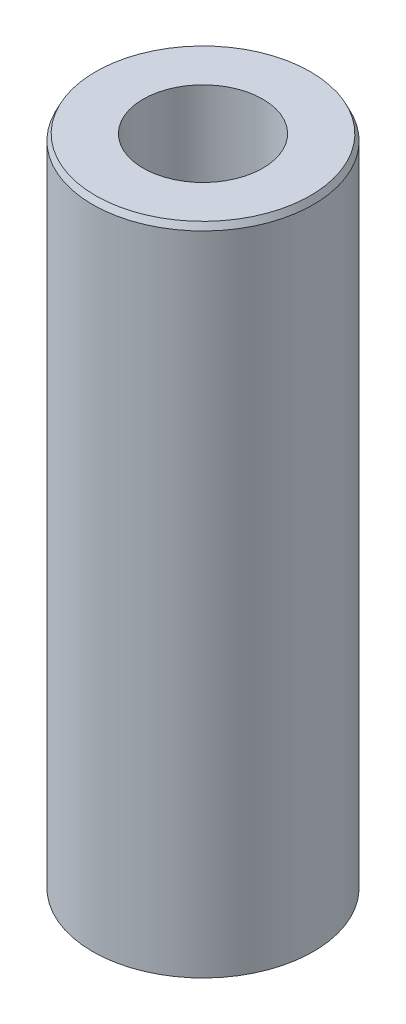
ISO-10303-21;
HEADER;
FILE_DESCRIPTION(('STEP AP214'),'2;1');
FILE_NAME('part.step','',(''),(''),'','','');
FILE_SCHEMA(('AUTOMOTIVE_DESIGN { 1 0 10303 214 1 1 1 1 }'));
ENDSEC;
DATA;
#1=APPLICATION_CONTEXT('core data for automotive mechanical design processes');
#2=APPLICATION_PROTOCOL_DEFINITION('international standard','automotive_design',2000,#1);
#3=PRODUCT_CONTEXT('',#1,'mechanical');
#4=PRODUCT('Part','Part','',(#3));
#5=PRODUCT_RELATED_PRODUCT_CATEGORY('part','',(#4));
#6=PRODUCT_DEFINITION_FORMATION('','',#4);
#7=PRODUCT_DEFINITION_CONTEXT('part definition',#1,'design');
#8=PRODUCT_DEFINITION('design','',#6,#7);
#9=PRODUCT_DEFINITION_SHAPE('','',#8);
#10=(LENGTH_UNIT() NAMED_UNIT(*) SI_UNIT(.MILLI.,.METRE.));
#11=(NAMED_UNIT(*) PLANE_ANGLE_UNIT() SI_UNIT($,.RADIAN.));
#12=(NAMED_UNIT(*) SI_UNIT($,.STERADIAN.) SOLID_ANGLE_UNIT());
#13=UNCERTAINTY_MEASURE_WITH_UNIT(LENGTH_MEASURE(1.E-05),#10,'distance_accuracy_value','');
#14=(GEOMETRIC_REPRESENTATION_CONTEXT(3) GLOBAL_UNCERTAINTY_ASSIGNED_CONTEXT((#13)) GLOBAL_UNIT_ASSIGNED_CONTEXT((#10,
#11,#12)) REPRESENTATION_CONTEXT('',''));
#15=CARTESIAN_POINT('',(0.,0.,0.));
#16=DIRECTION('',(0.,0.,1.));
#17=DIRECTION('',(1.,0.,0.));
#18=AXIS2_PLACEMENT_3D('',#15,#16,#17);
#19=CARTESIAN_POINT('',(0.,104.013752389961,0.));
#20=DIRECTION('',(0.,-1.,0.));
#21=DIRECTION('',(0.,0.,-1.));
#22=AXIS2_PLACEMENT_3D('',#19,#20,#21);
#23=CYLINDRICAL_SURFACE('',#22,17.5);
#24=CARTESIAN_POINT('',(0.,103.024281942731,0.));
#25=DIRECTION('',(0.,1.,0.));
#26=DIRECTION('',(0.,0.,1.));
#27=AXIS2_PLACEMENT_3D('',#24,#25,#26);
#28=CIRCLE('',#27,17.5);
#29=CARTESIAN_POINT('',(0.,103.024281942731,-17.5));
#30=VERTEX_POINT('',#29);
#31=EDGE_CURVE('E50',#30,#30,#28,.F.);
#32=CARTESIAN_POINT('',(0.,0.47584331856744,0.));
#33=DIRECTION('',(0.,1.,0.));
#34=DIRECTION('',(0.,0.,1.));
#35=AXIS2_PLACEMENT_3D('',#32,#33,#34);
#36=CIRCLE('',#35,17.5);
#37=CARTESIAN_POINT('',(0.,0.475843318567426,-17.5));
#38=VERTEX_POINT('',#37);
#39=EDGE_CURVE('E51',#38,#38,#36,.T.);
#40=CARTESIAN_POINT('',(0.,103.024281942731,-17.5));
#41=CARTESIAN_POINT('',(0.,101.956069040396,-17.5));
#42=CARTESIAN_POINT('',(0.,100.887856138061,-17.5));
#43=CARTESIAN_POINT('',(0.,98.7514303333907,-17.5));
#44=CARTESIAN_POINT('',(0.,97.6832174310557,-17.5));
#45=CARTESIAN_POINT('',(0.,95.5467916263856,-17.5));
#46=CARTESIAN_POINT('',(0.,94.4785787240505,-17.5));
#47=CARTESIAN_POINT('',(0.,92.3421529193805,-17.5));
#48=CARTESIAN_POINT('',(0.,91.2739400170454,-17.5));
#49=CARTESIAN_POINT('',(0.,89.1375142123754,-17.5));
#50=CARTESIAN_POINT('',(0.,88.0693013100403,-17.5));
#51=CARTESIAN_POINT('',(0.,85.9328755053702,-17.5));
#52=CARTESIAN_POINT('',(0.,84.8646626030352,-17.5));
#53=CARTESIAN_POINT('',(0.,82.7282367983651,-17.5));
#54=CARTESIAN_POINT('',(0.,81.6600238960301,-17.5));
#55=CARTESIAN_POINT('',(0.,79.52359809136,-17.5));
#56=CARTESIAN_POINT('',(0.,78.455385189025,-17.5));
#57=CARTESIAN_POINT('',(0.,76.3189593843549,-17.5));
#58=CARTESIAN_POINT('',(0.,75.2507464820199,-17.5));
#59=CARTESIAN_POINT('',(0.,73.1143206773498,-17.5));
#60=CARTESIAN_POINT('',(0.,72.0461077750148,-17.5));
#61=CARTESIAN_POINT('',(0.,69.9096819703447,-17.5));
#62=CARTESIAN_POINT('',(0.,68.8414690680097,-17.5));
#63=CARTESIAN_POINT('',(0.,66.7050432633396,-17.5));
#64=CARTESIAN_POINT('',(0.,65.6368303610046,-17.5));
#65=CARTESIAN_POINT('',(0.,63.5004045563345,-17.5));
#66=CARTESIAN_POINT('',(0.,62.4321916539995,-17.5));
#67=CARTESIAN_POINT('',(0.,60.2957658493294,-17.5));
#68=CARTESIAN_POINT('',(0.,59.2275529469944,-17.5));
#69=CARTESIAN_POINT('',(0.,57.0911271423243,-17.5));
#70=CARTESIAN_POINT('',(0.,56.0229142399893,-17.5));
#71=CARTESIAN_POINT('',(0.,53.8864884353192,-17.5));
#72=CARTESIAN_POINT('',(0.,52.8182755329842,-17.5));
#73=CARTESIAN_POINT('',(0.,50.6818497283141,-17.5));
#74=CARTESIAN_POINT('',(0.,49.6136368259791,-17.5));
#75=CARTESIAN_POINT('',(0.,47.477211021309,-17.5));
#76=CARTESIAN_POINT('',(0.,46.408998118974,-17.5));
#77=CARTESIAN_POINT('',(0.,44.2725723143039,-17.5));
#78=CARTESIAN_POINT('',(0.,43.2043594119688,-17.5));
#79=CARTESIAN_POINT('',(0.,41.0679336072988,-17.5));
#80=CARTESIAN_POINT('',(0.,39.9997207049637,-17.5));
#81=CARTESIAN_POINT('',(0.,37.8632949002937,-17.5));
#82=CARTESIAN_POINT('',(0.,36.7950819979586,-17.5));
#83=CARTESIAN_POINT('',(0.,34.6586561932886,-17.5));
#84=CARTESIAN_POINT('',(0.,33.5904432909535,-17.5));
#85=CARTESIAN_POINT('',(0.,31.4540174862835,-17.5));
#86=CARTESIAN_POINT('',(0.,30.3858045839484,-17.5));
#87=CARTESIAN_POINT('',(0.,28.2493787792783,-17.5));
#88=CARTESIAN_POINT('',(0.,27.1811658769433,-17.5));
#89=CARTESIAN_POINT('',(0.,25.0447400722732,-17.5));
#90=CARTESIAN_POINT('',(0.,23.9765271699382,-17.5));
#91=CARTESIAN_POINT('',(0.,21.8401013652681,-17.5));
#92=CARTESIAN_POINT('',(0.,20.7718884629331,-17.5));
#93=CARTESIAN_POINT('',(0.,18.635462658263,-17.5));
#94=CARTESIAN_POINT('',(0.,17.567249755928,-17.5));
#95=CARTESIAN_POINT('',(0.,15.4308239512579,-17.5));
#96=CARTESIAN_POINT('',(0.,14.3626110489229,-17.5));
#97=CARTESIAN_POINT('',(0.,12.2261852442528,-17.5));
#98=CARTESIAN_POINT('',(0.,11.1579723419178,-17.5));
#99=CARTESIAN_POINT('',(0.,9.02154653724771,-17.5));
#100=CARTESIAN_POINT('',(0.,7.95333363491267,-17.5));
#101=CARTESIAN_POINT('',(0.,5.8169078302426,-17.5));
#102=CARTESIAN_POINT('',(0.,4.74869492790756,-17.5));
#103=CARTESIAN_POINT('',(0.,2.6122691232375,-17.5));
#104=CARTESIAN_POINT('',(0.,1.54405622090246,-17.5));
#105=CARTESIAN_POINT('',(0.,0.475843318567426,-17.5));
#106=B_SPLINE_CURVE_WITH_KNOTS('',3,(#40,#41,#42,#43,#44,#45,#46,#47,#48,#49,#50,#51,#52,#53,
#54,#55,#56,#57,#58,#59,#60,#61,#62,#63,#64,#65,#66,#67,#68,#69,#70,#71,#72,#73,#74,#75,#76,#77,
#78,#79,#80,#81,#82,#83,#84,#85,#86,#87,#88,#89,#90,#91,#92,#93,#94,#95,#96,#97,#98,#99,#100,
#101,#102,#103,#104,#105),.UNSPECIFIED.,.F.,.F.,(4,2,2,2,2,2,2,2,2,2,2,2,2,2,2,2,2,2,2,2,2,2,2,
2,2,2,2,2,2,2,2,2,4),(0.,3.2046387070051,6.40927741401021,9.61391612101531,12.8185548280204,
16.0231935350255,19.2278322420306,22.4324709490357,25.6371096560408,28.8417483630459,
32.046387070051,35.2510257770562,38.4556644840613,41.6603031910664,44.8649418980715,
48.0695806050766,51.2742193120817,54.4788580190868,57.6834967260919,60.888135433097,
64.0927741401021,67.2974128471072,70.5020515541123,73.7066902611174,76.9113289681225,
80.1159676751276,83.3206063821328,86.5252450891379,89.729883796143,92.9345225031481,
96.1391612101532,99.3437999171583,102.548438624163),.UNSPECIFIED.);
#107=EDGE_CURVE('BSEAM39',#30,#38,#106,.T.);
#108=ORIENTED_EDGE('',*,*,#31,.T.);
#109=ORIENTED_EDGE('',*,*,#39,.T.);
#110=ORIENTED_EDGE('',*,*,#107,.T.);
#111=ORIENTED_EDGE('',*,*,#107,.F.);
#112=EDGE_LOOP('',(#108,#110,#109,#111));
#113=FACE_BOUND('',#112,.T.);
#114=ADVANCED_FACE('F39',(#113),#23,.T.);
#115=CARTESIAN_POINT('',(0.,104.013752389961,0.));
#116=DIRECTION('',(0.,1.,0.));
#117=DIRECTION('',(0.,0.,1.));
#118=AXIS2_PLACEMENT_3D('',#115,#116,#117);
#119=PLANE('',#118);
#120=CARTESIAN_POINT('',(0.,104.013752389961,0.));
#121=DIRECTION('',(0.,1.,0.));
#122=DIRECTION('',(0.,0.,1.));
#123=AXIS2_PLACEMENT_3D('',#120,#121,#122);
#124=CIRCLE('',#123,17.0241566814326);
#125=CARTESIAN_POINT('',(0.,104.013752389961,17.0241566814326));
#126=VERTEX_POINT('',#125);
#127=EDGE_CURVE('E54',#126,#126,#124,.T.);
#128=ORIENTED_EDGE('',*,*,#127,.T.);
#129=EDGE_LOOP('',(#128));
#130=FACE_BOUND('',#129,.T.);
#131=CARTESIAN_POINT('',(0.,104.013752389961,0.));
#132=DIRECTION('',(0.,1.,0.));
#133=DIRECTION('',(0.,0.,1.));
#134=AXIS2_PLACEMENT_3D('',#131,#132,#133);
#135=CIRCLE('',#134,9.48543287111657);
#136=CARTESIAN_POINT('',(0.,104.013752389961,-9.48543287111657));
#137=VERTEX_POINT('',#136);
#138=EDGE_CURVE('E58',#137,#137,#135,.T.);
#139=ORIENTED_EDGE('',*,*,#138,.F.);
#140=EDGE_LOOP('',(#139));
#141=FACE_BOUND('',#140,.T.);
#142=ADVANCED_FACE('F69',(#130,#141),#119,.T.);
#143=CARTESIAN_POINT('',(0.,0.,0.));
#144=DIRECTION('',(0.,1.,0.));
#145=DIRECTION('',(0.,0.,1.));
#146=AXIS2_PLACEMENT_3D('',#143,#144,#145);
#147=PLANE('',#146);
#148=CARTESIAN_POINT('',(0.,0.,0.));
#149=DIRECTION('',(0.,1.,0.));
#150=DIRECTION('',(0.,0.,1.));
#151=AXIS2_PLACEMENT_3D('',#148,#149,#150);
#152=CIRCLE('',#151,16.5105295527696);
#153=CARTESIAN_POINT('',(0.,0.,16.5105295527696));
#154=VERTEX_POINT('',#153);
#155=EDGE_CURVE('E10',#154,#154,#152,.F.);
#156=ORIENTED_EDGE('',*,*,#155,.T.);
#157=EDGE_LOOP('',(#156));
#158=FACE_BOUND('',#157,.T.);
#159=CARTESIAN_POINT('',(0.,0.,0.));
#160=DIRECTION('',(0.,1.,0.));
#161=DIRECTION('',(0.,0.,1.));
#162=AXIS2_PLACEMENT_3D('',#159,#160,#161);
#163=CIRCLE('',#162,9.48543287111657);
#164=CARTESIAN_POINT('',(0.,0.,-9.48543287111657));
#165=VERTEX_POINT('',#164);
#166=EDGE_CURVE('E63',#165,#165,#163,.T.);
#167=ORIENTED_EDGE('',*,*,#166,.T.);
#168=EDGE_LOOP('',(#167));
#169=FACE_BOUND('',#168,.T.);
#170=ADVANCED_FACE('F75',(#158,#169),#147,.F.);
#171=CARTESIAN_POINT('',(0.,104.013752389961,0.));
#172=DIRECTION('',(0.,-1.,0.));
#173=DIRECTION('',(0.,0.,-1.));
#174=AXIS2_PLACEMENT_3D('',#171,#172,#173);
#175=CYLINDRICAL_SURFACE('',#174,9.48543287111657);
#176=CARTESIAN_POINT('',(0.,104.013752389961,-9.48543287111657));
#177=CARTESIAN_POINT('',(0.,102.930275802566,-9.48543287111657));
#178=CARTESIAN_POINT('',(0.,101.84679921517,-9.48543287111657));
#179=CARTESIAN_POINT('',(0.,99.6798460403794,-9.48543287111657));
#180=CARTESIAN_POINT('',(0.,98.596369452984,-9.48543287111657));
#181=CARTESIAN_POINT('',(0.,96.4294162781931,-9.48543287111657));
#182=CARTESIAN_POINT('',(0.,95.3459396907977,-9.48543287111657));
#183=CARTESIAN_POINT('',(0.,93.1789865160068,-9.48543287111657));
#184=CARTESIAN_POINT('',(0.,92.0955099286114,-9.48543287111657));
#185=CARTESIAN_POINT('',(0.,89.9285567538206,-9.48543287111657));
#186=CARTESIAN_POINT('',(0.,88.8450801664251,-9.48543287111657));
#187=CARTESIAN_POINT('',(0.,86.6781269916343,-9.48543287111657));
#188=CARTESIAN_POINT('',(0.,85.5946504042388,-9.48543287111657));
#189=CARTESIAN_POINT('',(0.,83.427697229448,-9.48543287111657));
#190=CARTESIAN_POINT('',(0.,82.3442206420525,-9.48543287111657));
#191=CARTESIAN_POINT('',(0.,80.1772674672617,-9.48543287111657));
#192=CARTESIAN_POINT('',(0.,79.0937908798663,-9.48543287111657));
#193=CARTESIAN_POINT('',(0.,76.9268377050754,-9.48543287111657));
#194=CARTESIAN_POINT('',(0.,75.84336111768,-9.48543287111657));
#195=CARTESIAN_POINT('',(0.,73.6764079428891,-9.48543287111657));
#196=CARTESIAN_POINT('',(0.,72.5929313554937,-9.48543287111657));
#197=CARTESIAN_POINT('',(0.,70.4259781807028,-9.48543287111657));
#198=CARTESIAN_POINT('',(0.,69.3425015933074,-9.48543287111657));
#199=CARTESIAN_POINT('',(0.,67.1755484185166,-9.48543287111657));
#200=CARTESIAN_POINT('',(0.,66.0920718311211,-9.48543287111657));
#201=CARTESIAN_POINT('',(0.,63.9251186563303,-9.48543287111657));
#202=CARTESIAN_POINT('',(0.,62.8416420689348,-9.48543287111657));
#203=CARTESIAN_POINT('',(0.,60.674688894144,-9.48543287111657));
#204=CARTESIAN_POINT('',(0.,59.5912123067486,-9.48543287111657));
#205=CARTESIAN_POINT('',(0.,57.4242591319577,-9.48543287111657));
#206=CARTESIAN_POINT('',(0.,56.3407825445623,-9.48543287111657));
#207=CARTESIAN_POINT('',(0.,54.1738293697714,-9.48543287111657));
#208=CARTESIAN_POINT('',(0.,53.090352782376,-9.48543287111657));
#209=CARTESIAN_POINT('',(0.,50.9233996075851,-9.48543287111657));
#210=CARTESIAN_POINT('',(0.,49.8399230201897,-9.48543287111657));
#211=CARTESIAN_POINT('',(0.,47.6729698453988,-9.48543287111657));
#212=CARTESIAN_POINT('',(0.,46.5894932580034,-9.48543287111657));
#213=CARTESIAN_POINT('',(0.,44.4225400832126,-9.48543287111657));
#214=CARTESIAN_POINT('',(0.,43.3390634958171,-9.48543287111657));
#215=CARTESIAN_POINT('',(0.,41.1721103210263,-9.48543287111657));
#216=CARTESIAN_POINT('',(0.,40.0886337336309,-9.48543287111657));
#217=CARTESIAN_POINT('',(0.,37.92168055884,-9.48543287111657));
#218=CARTESIAN_POINT('',(0.,36.8382039714446,-9.48543287111657));
#219=CARTESIAN_POINT('',(0.,34.6712507966537,-9.48543287111657));
#220=CARTESIAN_POINT('',(0.,33.5877742092583,-9.48543287111657));
#221=CARTESIAN_POINT('',(0.,31.4208210344674,-9.48543287111657));
#222=CARTESIAN_POINT('',(0.,30.337344447072,-9.48543287111657));
#223=CARTESIAN_POINT('',(0.,28.1703912722811,-9.48543287111657));
#224=CARTESIAN_POINT('',(0.,27.0869146848857,-9.48543287111657));
#225=CARTESIAN_POINT('',(0.,24.9199615100949,-9.48543287111657));
#226=CARTESIAN_POINT('',(0.,23.8364849226994,-9.48543287111657));
#227=CARTESIAN_POINT('',(0.,21.6695317479086,-9.48543287111657));
#228=CARTESIAN_POINT('',(0.,20.5860551605131,-9.48543287111657));
#229=CARTESIAN_POINT('',(0.,18.4191019857223,-9.48543287111657));
#230=CARTESIAN_POINT('',(0.,17.3356253983269,-9.48543287111657));
#231=CARTESIAN_POINT('',(0.,15.168672223536,-9.48543287111657));
#232=CARTESIAN_POINT('',(0.,14.0851956361406,-9.48543287111657));
#233=CARTESIAN_POINT('',(0.,11.9182424613497,-9.48543287111657));
#234=CARTESIAN_POINT('',(0.,10.8347658739543,-9.48543287111657));
#235=CARTESIAN_POINT('',(0.,8.66781269916343,-9.48543287111657));
#236=CARTESIAN_POINT('',(0.,7.584336111768,-9.48543287111657));
#237=CARTESIAN_POINT('',(0.,5.41738293697714,-9.48543287111657));
#238=CARTESIAN_POINT('',(0.,4.33390634958171,-9.48543287111657));
#239=CARTESIAN_POINT('',(0.,2.16695317479086,-9.48543287111657));
#240=CARTESIAN_POINT('',(0.,1.08347658739543,-9.48543287111657));
#241=CARTESIAN_POINT('',(0.,0.,-9.48543287111657));
#242=B_SPLINE_CURVE_WITH_KNOTS('',3,(#176,#177,#178,#179,#180,#181,#182,#183,#184,#185,#186,
#187,#188,#189,#190,#191,#192,#193,#194,#195,#196,#197,#198,#199,#200,#201,#202,#203,#204,#205,
#206,#207,#208,#209,#210,#211,#212,#213,#214,#215,#216,#217,#218,#219,#220,#221,#222,#223,#224,
#225,#226,#227,#228,#229,#230,#231,#232,#233,#234,#235,#236,#237,#238,#239,#240,#241),
.UNSPECIFIED.,.F.,.F.,(4,2,2,2,2,2,2,2,2,2,2,2,2,2,2,2,2,2,2,2,2,2,2,2,2,2,2,2,2,2,2,2,4),(0.,
3.25042976218629,6.50085952437257,9.75128928655886,13.0017190487451,16.2521488109314,
19.5025785731177,22.753008335304,26.0034380974903,29.2538678596766,32.5042976218629,
35.7547273840491,39.0051571462354,42.2555869084217,45.506016670608,48.7564464327943,
52.0068761949806,55.2573059571668,58.5077357193531,61.7581654815394,65.0085952437257,
68.259025005912,71.5094547680983,74.7598845302846,78.0103142924708,81.2607440546571,
84.5111738168434,87.7616035790297,91.012033341216,94.2624631034023,97.5128928655886,
100.763322627775,104.013752389961),.UNSPECIFIED.);
#243=EDGE_CURVE('BSEAM70',#137,#165,#242,.T.);
#244=ORIENTED_EDGE('',*,*,#138,.T.);
#245=ORIENTED_EDGE('',*,*,#166,.F.);
#246=ORIENTED_EDGE('',*,*,#243,.T.);
#247=ORIENTED_EDGE('',*,*,#243,.F.);
#248=EDGE_LOOP('',(#244,#246,#245,#247));
#249=FACE_BOUND('',#248,.T.);
#250=ADVANCED_FACE('F70',(#249),#175,.F.);
#251=CARTESIAN_POINT('',(0.,104.013752389961,0.));
#252=DIRECTION('',(0.,-1.,0.));
#253=DIRECTION('',(0.,0.,-1.));
#254=AXIS2_PLACEMENT_3D('',#251,#252,#253);
#255=CONICAL_SURFACE('',#254,17.0241566814326,0.448256917419232);
#256=ORIENTED_EDGE('',*,*,#31,.F.);
#257=EDGE_LOOP('',(#256));
#258=FACE_BOUND('',#257,.T.);
#259=ORIENTED_EDGE('',*,*,#127,.F.);
#260=EDGE_LOOP('',(#259));
#261=FACE_BOUND('',#260,.T.);
#262=ADVANCED_FACE('F81',(#258,#261),#255,.T.);
#263=CARTESIAN_POINT('',(0.,0.47584331856744,0.));
#264=DIRECTION('',(0.,1.,0.));
#265=DIRECTION('',(0.,0.,1.));
#266=AXIS2_PLACEMENT_3D('',#263,#264,#265);
#267=CONICAL_SURFACE('',#266,17.5,1.12253940937567);
#268=ORIENTED_EDGE('',*,*,#155,.F.);
#269=EDGE_LOOP('',(#268));
#270=FACE_BOUND('',#269,.T.);
#271=ORIENTED_EDGE('',*,*,#39,.F.);
#272=EDGE_LOOP('',(#271));
#273=FACE_BOUND('',#272,.T.);
#274=ADVANCED_FACE('F45',(#270,#273),#267,.T.);
#275=CLOSED_SHELL('',(#114,#142,#170,#250,#262,#274));
#276=MANIFOLD_SOLID_BREP('B2',#275);
#277=ADVANCED_BREP_SHAPE_REPRESENTATION('',(#18,#276),#14);
#278=SHAPE_DEFINITION_REPRESENTATION(#9,#277);
ENDSEC;
END-ISO-10303-21;
